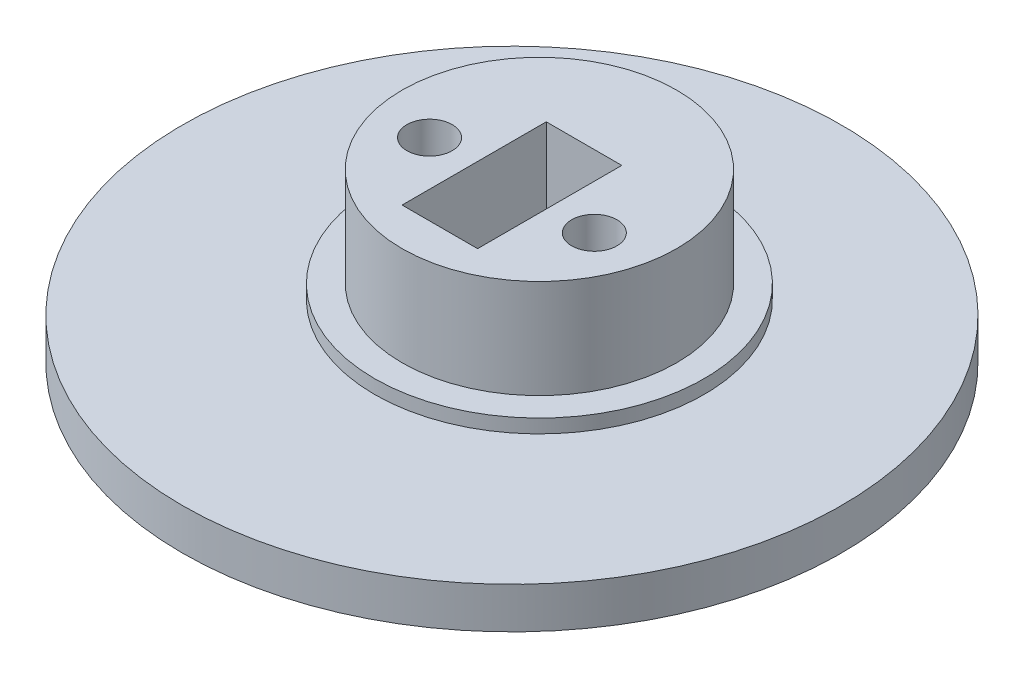
ISO-10303-21;
HEADER;
FILE_DESCRIPTION(('STEP AP214'),'2;1');
FILE_NAME('part.step','',(''),(''),'','','');
FILE_SCHEMA(('AUTOMOTIVE_DESIGN { 1 0 10303 214 1 1 1 1 }'));
ENDSEC;
DATA;
#1=APPLICATION_CONTEXT('core data for automotive mechanical design processes');
#2=APPLICATION_PROTOCOL_DEFINITION('international standard','automotive_design',2000,#1);
#3=PRODUCT_CONTEXT('',#1,'mechanical');
#4=PRODUCT('Part','Part','',(#3));
#5=PRODUCT_RELATED_PRODUCT_CATEGORY('part','',(#4));
#6=PRODUCT_DEFINITION_FORMATION('','',#4);
#7=PRODUCT_DEFINITION_CONTEXT('part definition',#1,'design');
#8=PRODUCT_DEFINITION('design','',#6,#7);
#9=PRODUCT_DEFINITION_SHAPE('','',#8);
#10=(LENGTH_UNIT() NAMED_UNIT(*) SI_UNIT(.MILLI.,.METRE.));
#11=(NAMED_UNIT(*) PLANE_ANGLE_UNIT() SI_UNIT($,.RADIAN.));
#12=(NAMED_UNIT(*) SI_UNIT($,.STERADIAN.) SOLID_ANGLE_UNIT());
#13=UNCERTAINTY_MEASURE_WITH_UNIT(LENGTH_MEASURE(1.E-05),#10,'distance_accuracy_value','');
#14=(GEOMETRIC_REPRESENTATION_CONTEXT(3) GLOBAL_UNCERTAINTY_ASSIGNED_CONTEXT((#13)) GLOBAL_UNIT_ASSIGNED_CONTEXT((#10,
#11,#12)) REPRESENTATION_CONTEXT('',''));
#15=CARTESIAN_POINT('',(0.,0.,0.));
#16=DIRECTION('',(0.,0.,1.));
#17=DIRECTION('',(1.,0.,0.));
#18=AXIS2_PLACEMENT_3D('',#15,#16,#17);
#19=CARTESIAN_POINT('',(0.,3.,0.));
#20=DIRECTION('',(0.,1.,0.));
#21=DIRECTION('',(0.,0.,1.));
#22=AXIS2_PLACEMENT_3D('',#19,#20,#21);
#23=PLANE('',#22);
#24=CARTESIAN_POINT('',(0.,3.,0.));
#25=DIRECTION('',(0.,1.,0.));
#26=DIRECTION('',(0.,0.,1.));
#27=AXIS2_PLACEMENT_3D('',#24,#25,#26);
#28=CIRCLE('',#27,24.);
#29=CARTESIAN_POINT('',(0.,3.,24.));
#30=VERTEX_POINT('',#29);
#31=EDGE_CURVE('E50',#30,#30,#28,.T.);
#32=ORIENTED_EDGE('',*,*,#31,.T.);
#33=EDGE_LOOP('',(#32));
#34=FACE_BOUND('',#33,.T.);
#35=CARTESIAN_POINT('',(0.,3.,-2.));
#36=DIRECTION('',(0.,1.,0.));
#37=DIRECTION('',(0.,0.,1.));
#38=AXIS2_PLACEMENT_3D('',#35,#36,#37);
#39=CIRCLE('',#38,12.);
#40=CARTESIAN_POINT('',(0.,3.,10.));
#41=VERTEX_POINT('',#40);
#42=EDGE_CURVE('E115',#41,#41,#39,.T.);
#43=ORIENTED_EDGE('',*,*,#42,.F.);
#44=EDGE_LOOP('',(#43));
#45=FACE_BOUND('',#44,.T.);
#46=ADVANCED_FACE('F41',(#34,#45),#23,.T.);
#47=CARTESIAN_POINT('',(0.,0.,0.));
#48=DIRECTION('',(0.,1.,0.));
#49=DIRECTION('',(0.,0.,1.));
#50=AXIS2_PLACEMENT_3D('',#47,#48,#49);
#51=PLANE('',#50);
#52=CARTESIAN_POINT('',(6.,0.,0.));
#53=DIRECTION('',(0.,1.,0.));
#54=DIRECTION('',(0.,0.,1.));
#55=AXIS2_PLACEMENT_3D('',#52,#53,#54);
#56=CIRCLE('',#55,1.65);
#57=CARTESIAN_POINT('',(6.,0.,1.65));
#58=VERTEX_POINT('',#57);
#59=EDGE_CURVE('E133',#58,#58,#56,.T.);
#60=ORIENTED_EDGE('',*,*,#59,.T.);
#61=EDGE_LOOP('',(#60));
#62=FACE_BOUND('',#61,.T.);
#63=CARTESIAN_POINT('',(-6.,0.,0.));
#64=DIRECTION('',(0.,1.,0.));
#65=DIRECTION('',(0.,0.,1.));
#66=AXIS2_PLACEMENT_3D('',#63,#64,#65);
#67=CIRCLE('',#66,1.65);
#68=CARTESIAN_POINT('',(-6.,0.,1.65));
#69=VERTEX_POINT('',#68);
#70=EDGE_CURVE('E136',#69,#69,#67,.T.);
#71=ORIENTED_EDGE('',*,*,#70,.T.);
#72=EDGE_LOOP('',(#71));
#73=FACE_BOUND('',#72,.T.);
#74=CARTESIAN_POINT('',(0.,0.,0.));
#75=DIRECTION('',(0.,1.,0.));
#76=DIRECTION('',(0.,0.,1.));
#77=AXIS2_PLACEMENT_3D('',#74,#75,#76);
#78=CIRCLE('',#77,24.);
#79=CARTESIAN_POINT('',(0.,0.,24.));
#80=VERTEX_POINT('',#79);
#81=EDGE_CURVE('E45',#80,#80,#78,.T.);
#82=ORIENTED_EDGE('',*,*,#81,.F.);
#83=EDGE_LOOP('',(#82));
#84=FACE_BOUND('',#83,.T.);
#85=DIRECTION('',(0.,0.,1.));
#86=VECTOR('',#85,1.);
#87=CARTESIAN_POINT('',(-2.75,0.,5.25));
#88=LINE('',#87,#86);
#89=CARTESIAN_POINT('',(-2.75,0.,-5.25));
#90=VERTEX_POINT('',#89);
#91=CARTESIAN_POINT('',(-2.75,0.,5.25));
#92=VERTEX_POINT('',#91);
#93=EDGE_CURVE('E58',#90,#92,#88,.T.);
#94=ORIENTED_EDGE('',*,*,#93,.T.);
#95=DIRECTION('',(1.,0.,0.));
#96=VECTOR('',#95,1.);
#97=CARTESIAN_POINT('',(2.75,0.,5.25));
#98=LINE('',#97,#96);
#99=CARTESIAN_POINT('',(2.75,0.,5.25));
#100=VERTEX_POINT('',#99);
#101=EDGE_CURVE('E123',#92,#100,#98,.T.);
#102=ORIENTED_EDGE('',*,*,#101,.T.);
#103=DIRECTION('',(0.,0.,-1.));
#104=VECTOR('',#103,1.);
#105=CARTESIAN_POINT('',(2.75,0.,5.25));
#106=LINE('',#105,#104);
#107=CARTESIAN_POINT('',(2.75,0.,-5.25));
#108=VERTEX_POINT('',#107);
#109=EDGE_CURVE('E90',#100,#108,#106,.T.);
#110=ORIENTED_EDGE('',*,*,#109,.T.);
#111=DIRECTION('',(-1.,0.,0.));
#112=VECTOR('',#111,1.);
#113=CARTESIAN_POINT('',(2.75,0.,-5.25));
#114=LINE('',#113,#112);
#115=EDGE_CURVE('E126',#108,#90,#114,.T.);
#116=ORIENTED_EDGE('',*,*,#115,.T.);
#117=EDGE_LOOP('',(#94,#102,#110,#116));
#118=FACE_BOUND('',#117,.T.);
#119=ADVANCED_FACE('F145',(#62,#73,#84,#118),#51,.F.);
#120=CARTESIAN_POINT('',(0.,3.,0.));
#121=DIRECTION('',(0.,-1.,0.));
#122=DIRECTION('',(0.,0.,-1.));
#123=AXIS2_PLACEMENT_3D('',#120,#121,#122);
#124=CYLINDRICAL_SURFACE('',#123,24.);
#125=ORIENTED_EDGE('',*,*,#31,.F.);
#126=EDGE_LOOP('',(#125));
#127=FACE_BOUND('',#126,.T.);
#128=ORIENTED_EDGE('',*,*,#81,.T.);
#129=EDGE_LOOP('',(#128));
#130=FACE_BOUND('',#129,.T.);
#131=ADVANCED_FACE('F43',(#127,#130),#124,.T.);
#132=CARTESIAN_POINT('',(-6.,3.,0.));
#133=DIRECTION('',(0.,-1.,0.));
#134=DIRECTION('',(0.,0.,-1.));
#135=AXIS2_PLACEMENT_3D('',#132,#133,#134);
#136=CYLINDRICAL_SURFACE('',#135,1.65);
#137=ORIENTED_EDGE('',*,*,#70,.F.);
#138=EDGE_LOOP('',(#137));
#139=FACE_BOUND('',#138,.T.);
#140=CARTESIAN_POINT('',(-6.,11.2,0.));
#141=DIRECTION('',(0.,1.,0.));
#142=DIRECTION('',(0.,0.,1.));
#143=AXIS2_PLACEMENT_3D('',#140,#141,#142);
#144=CIRCLE('',#143,1.65);
#145=CARTESIAN_POINT('',(-6.,11.2,1.65));
#146=VERTEX_POINT('',#145);
#147=EDGE_CURVE('E101',#146,#146,#144,.T.);
#148=ORIENTED_EDGE('',*,*,#147,.T.);
#149=EDGE_LOOP('',(#148));
#150=FACE_BOUND('',#149,.T.);
#151=ADVANCED_FACE('F160',(#139,#150),#136,.F.);
#152=CARTESIAN_POINT('',(6.,3.,0.));
#153=DIRECTION('',(0.,-1.,0.));
#154=DIRECTION('',(0.,0.,-1.));
#155=AXIS2_PLACEMENT_3D('',#152,#153,#154);
#156=CYLINDRICAL_SURFACE('',#155,1.65);
#157=ORIENTED_EDGE('',*,*,#59,.F.);
#158=EDGE_LOOP('',(#157));
#159=FACE_BOUND('',#158,.T.);
#160=CARTESIAN_POINT('',(6.,11.2,0.));
#161=DIRECTION('',(0.,1.,0.));
#162=DIRECTION('',(0.,0.,1.));
#163=AXIS2_PLACEMENT_3D('',#160,#161,#162);
#164=CIRCLE('',#163,1.65);
#165=CARTESIAN_POINT('',(6.,11.2,1.65));
#166=VERTEX_POINT('',#165);
#167=EDGE_CURVE('E181',#166,#166,#164,.T.);
#168=ORIENTED_EDGE('',*,*,#167,.T.);
#169=EDGE_LOOP('',(#168));
#170=FACE_BOUND('',#169,.T.);
#171=ADVANCED_FACE('F153',(#159,#170),#156,.F.);
#172=CARTESIAN_POINT('',(-2.75,3.,5.25));
#173=DIRECTION('',(1.,0.,0.));
#174=DIRECTION('',(0.,0.,-1.));
#175=AXIS2_PLACEMENT_3D('',#172,#173,#174);
#176=PLANE('',#175);
#177=ORIENTED_EDGE('',*,*,#93,.F.);
#178=DIRECTION('',(0.,-1.,0.));
#179=VECTOR('',#178,1.);
#180=CARTESIAN_POINT('',(-2.75,3.,-5.25));
#181=LINE('',#180,#179);
#182=CARTESIAN_POINT('',(-2.75,11.2,-5.25));
#183=VERTEX_POINT('',#182);
#184=EDGE_CURVE('E129',#183,#90,#181,.T.);
#185=ORIENTED_EDGE('',*,*,#184,.F.);
#186=DIRECTION('',(0.,0.,1.));
#187=VECTOR('',#186,1.);
#188=CARTESIAN_POINT('',(-2.75,11.2,-5.25));
#189=LINE('',#188,#187);
#190=CARTESIAN_POINT('',(-2.75,11.2,5.25));
#191=VERTEX_POINT('',#190);
#192=EDGE_CURVE('E108',#183,#191,#189,.T.);
#193=ORIENTED_EDGE('',*,*,#192,.T.);
#194=DIRECTION('',(0.,-1.,0.));
#195=VECTOR('',#194,1.);
#196=CARTESIAN_POINT('',(-2.75,3.,5.25));
#197=LINE('',#196,#195);
#198=EDGE_CURVE('E93',#191,#92,#197,.T.);
#199=ORIENTED_EDGE('',*,*,#198,.T.);
#200=EDGE_LOOP('',(#177,#185,#193,#199));
#201=FACE_BOUND('',#200,.T.);
#202=ADVANCED_FACE('F151',(#201),#176,.T.);
#203=CARTESIAN_POINT('',(2.75,3.,5.25));
#204=DIRECTION('',(0.,0.,-1.));
#205=DIRECTION('',(-1.,0.,0.));
#206=AXIS2_PLACEMENT_3D('',#203,#204,#205);
#207=PLANE('',#206);
#208=ORIENTED_EDGE('',*,*,#101,.F.);
#209=ORIENTED_EDGE('',*,*,#198,.F.);
#210=DIRECTION('',(1.,0.,0.));
#211=VECTOR('',#210,1.);
#212=CARTESIAN_POINT('',(-2.75,11.2,5.25));
#213=LINE('',#212,#211);
#214=CARTESIAN_POINT('',(2.75,11.2,5.25));
#215=VERTEX_POINT('',#214);
#216=EDGE_CURVE('E96',#191,#215,#213,.T.);
#217=ORIENTED_EDGE('',*,*,#216,.T.);
#218=DIRECTION('',(0.,-1.,0.));
#219=VECTOR('',#218,1.);
#220=CARTESIAN_POINT('',(2.75,3.,5.25));
#221=LINE('',#220,#219);
#222=EDGE_CURVE('E83',#215,#100,#221,.T.);
#223=ORIENTED_EDGE('',*,*,#222,.T.);
#224=EDGE_LOOP('',(#208,#209,#217,#223));
#225=FACE_BOUND('',#224,.T.);
#226=ADVANCED_FACE('F97',(#225),#207,.T.);
#227=CARTESIAN_POINT('',(2.75,3.,5.25));
#228=DIRECTION('',(-1.,0.,0.));
#229=DIRECTION('',(0.,0.,1.));
#230=AXIS2_PLACEMENT_3D('',#227,#228,#229);
#231=PLANE('',#230);
#232=ORIENTED_EDGE('',*,*,#109,.F.);
#233=ORIENTED_EDGE('',*,*,#222,.F.);
#234=DIRECTION('',(0.,0.,-1.));
#235=VECTOR('',#234,1.);
#236=CARTESIAN_POINT('',(2.75,11.2,5.25));
#237=LINE('',#236,#235);
#238=CARTESIAN_POINT('',(2.75,11.2,-5.25));
#239=VERTEX_POINT('',#238);
#240=EDGE_CURVE('E87',#215,#239,#237,.T.);
#241=ORIENTED_EDGE('',*,*,#240,.T.);
#242=DIRECTION('',(0.,-1.,0.));
#243=VECTOR('',#242,1.);
#244=CARTESIAN_POINT('',(2.75,3.,-5.25));
#245=LINE('',#244,#243);
#246=EDGE_CURVE('E66',#239,#108,#245,.T.);
#247=ORIENTED_EDGE('',*,*,#246,.T.);
#248=EDGE_LOOP('',(#232,#233,#241,#247));
#249=FACE_BOUND('',#248,.T.);
#250=ADVANCED_FACE('F85',(#249),#231,.T.);
#251=CARTESIAN_POINT('',(2.75,3.,-5.25));
#252=DIRECTION('',(0.,0.,1.));
#253=DIRECTION('',(1.,0.,0.));
#254=AXIS2_PLACEMENT_3D('',#251,#252,#253);
#255=PLANE('',#254);
#256=ORIENTED_EDGE('',*,*,#115,.F.);
#257=ORIENTED_EDGE('',*,*,#246,.F.);
#258=DIRECTION('',(-1.,0.,0.));
#259=VECTOR('',#258,1.);
#260=CARTESIAN_POINT('',(2.75,11.2,-5.25));
#261=LINE('',#260,#259);
#262=EDGE_CURVE('E106',#239,#183,#261,.T.);
#263=ORIENTED_EDGE('',*,*,#262,.T.);
#264=ORIENTED_EDGE('',*,*,#184,.T.);
#265=EDGE_LOOP('',(#256,#257,#263,#264));
#266=FACE_BOUND('',#265,.T.);
#267=ADVANCED_FACE('F150',(#266),#255,.T.);
#268=CARTESIAN_POINT('',(0.,4.,-2.));
#269=DIRECTION('',(0.,1.,0.));
#270=DIRECTION('',(0.,0.,1.));
#271=AXIS2_PLACEMENT_3D('',#268,#269,#270);
#272=PLANE('',#271);
#273=CARTESIAN_POINT('',(0.,4.,-2.));
#274=DIRECTION('',(0.,1.,0.));
#275=DIRECTION('',(0.,0.,1.));
#276=AXIS2_PLACEMENT_3D('',#273,#274,#275);
#277=CIRCLE('',#276,10.);
#278=CARTESIAN_POINT('',(0.,4.,8.));
#279=VERTEX_POINT('',#278);
#280=EDGE_CURVE('E11',#279,#279,#277,.T.);
#281=ORIENTED_EDGE('',*,*,#280,.F.);
#282=EDGE_LOOP('',(#281));
#283=FACE_BOUND('',#282,.T.);
#284=CARTESIAN_POINT('',(0.,4.,-2.));
#285=DIRECTION('',(0.,1.,0.));
#286=DIRECTION('',(0.,0.,1.));
#287=AXIS2_PLACEMENT_3D('',#284,#285,#286);
#288=CIRCLE('',#287,12.);
#289=CARTESIAN_POINT('',(0.,4.,10.));
#290=VERTEX_POINT('',#289);
#291=EDGE_CURVE('E117',#290,#290,#288,.T.);
#292=ORIENTED_EDGE('',*,*,#291,.T.);
#293=EDGE_LOOP('',(#292));
#294=FACE_BOUND('',#293,.T.);
#295=ADVANCED_FACE('F196',(#283,#294),#272,.T.);
#296=CARTESIAN_POINT('',(0.,4.,-2.));
#297=DIRECTION('',(0.,-1.,0.));
#298=DIRECTION('',(0.,0.,-1.));
#299=AXIS2_PLACEMENT_3D('',#296,#297,#298);
#300=CYLINDRICAL_SURFACE('',#299,12.);
#301=ORIENTED_EDGE('',*,*,#291,.F.);
#302=EDGE_LOOP('',(#301));
#303=FACE_BOUND('',#302,.T.);
#304=ORIENTED_EDGE('',*,*,#42,.T.);
#305=EDGE_LOOP('',(#304));
#306=FACE_BOUND('',#305,.T.);
#307=ADVANCED_FACE('F188',(#303,#306),#300,.T.);
#308=CARTESIAN_POINT('',(0.,11.2,-2.));
#309=DIRECTION('',(0.,1.,0.));
#310=DIRECTION('',(0.,0.,1.));
#311=AXIS2_PLACEMENT_3D('',#308,#309,#310);
#312=PLANE('',#311);
#313=ORIENTED_EDGE('',*,*,#147,.F.);
#314=EDGE_LOOP('',(#313));
#315=FACE_BOUND('',#314,.T.);
#316=CARTESIAN_POINT('',(0.,11.2,-2.));
#317=DIRECTION('',(0.,1.,0.));
#318=DIRECTION('',(0.,0.,1.));
#319=AXIS2_PLACEMENT_3D('',#316,#317,#318);
#320=CIRCLE('',#319,10.);
#321=CARTESIAN_POINT('',(0.,11.2,8.));
#322=VERTEX_POINT('',#321);
#323=EDGE_CURVE('E113',#322,#322,#320,.T.);
#324=ORIENTED_EDGE('',*,*,#323,.T.);
#325=EDGE_LOOP('',(#324));
#326=FACE_BOUND('',#325,.T.);
#327=ORIENTED_EDGE('',*,*,#240,.F.);
#328=ORIENTED_EDGE('',*,*,#216,.F.);
#329=ORIENTED_EDGE('',*,*,#192,.F.);
#330=ORIENTED_EDGE('',*,*,#262,.F.);
#331=EDGE_LOOP('',(#327,#328,#329,#330));
#332=FACE_BOUND('',#331,.T.);
#333=ORIENTED_EDGE('',*,*,#167,.F.);
#334=EDGE_LOOP('',(#333));
#335=FACE_BOUND('',#334,.T.);
#336=ADVANCED_FACE('F103',(#315,#326,#332,#335),#312,.T.);
#337=CARTESIAN_POINT('',(0.,11.2,-2.));
#338=DIRECTION('',(0.,-1.,0.));
#339=DIRECTION('',(0.,0.,-1.));
#340=AXIS2_PLACEMENT_3D('',#337,#338,#339);
#341=CYLINDRICAL_SURFACE('',#340,10.);
#342=ORIENTED_EDGE('',*,*,#323,.F.);
#343=EDGE_LOOP('',(#342));
#344=FACE_BOUND('',#343,.T.);
#345=ORIENTED_EDGE('',*,*,#280,.T.);
#346=EDGE_LOOP('',(#345));
#347=FACE_BOUND('',#346,.T.);
#348=ADVANCED_FACE('F187',(#344,#347),#341,.T.);
#349=CLOSED_SHELL('',(#46,#119,#131,#151,#171,#202,#226,#250,#267,#295,#307,#336,#348));
#350=MANIFOLD_SOLID_BREP('B2',#349);
#351=ADVANCED_BREP_SHAPE_REPRESENTATION('',(#18,#350),#14);
#352=SHAPE_DEFINITION_REPRESENTATION(#9,#351);
ENDSEC;
END-ISO-10303-21;
